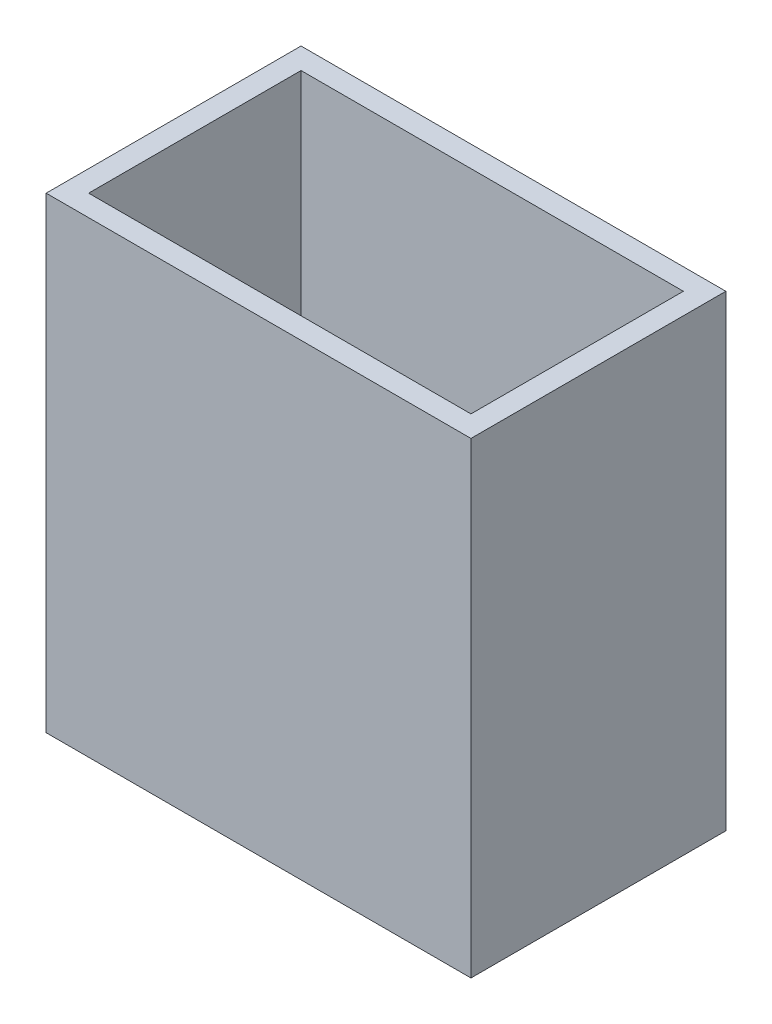
ISO-10303-21;
HEADER;
FILE_DESCRIPTION(('STEP AP214'),'2;1');
FILE_NAME('part.step','',(''),(''),'','','');
FILE_SCHEMA(('AUTOMOTIVE_DESIGN { 1 0 10303 214 1 1 1 1 }'));
ENDSEC;
DATA;
#1=APPLICATION_CONTEXT('core data for automotive mechanical design processes');
#2=APPLICATION_PROTOCOL_DEFINITION('international standard','automotive_design',2000,#1);
#3=PRODUCT_CONTEXT('',#1,'mechanical');
#4=PRODUCT('Part','Part','',(#3));
#5=PRODUCT_RELATED_PRODUCT_CATEGORY('part','',(#4));
#6=PRODUCT_DEFINITION_FORMATION('','',#4);
#7=PRODUCT_DEFINITION_CONTEXT('part definition',#1,'design');
#8=PRODUCT_DEFINITION('design','',#6,#7);
#9=PRODUCT_DEFINITION_SHAPE('','',#8);
#10=(LENGTH_UNIT() NAMED_UNIT(*) SI_UNIT(.MILLI.,.METRE.));
#11=(NAMED_UNIT(*) PLANE_ANGLE_UNIT() SI_UNIT($,.RADIAN.));
#12=(NAMED_UNIT(*) SI_UNIT($,.STERADIAN.) SOLID_ANGLE_UNIT());
#13=UNCERTAINTY_MEASURE_WITH_UNIT(LENGTH_MEASURE(1.E-05),#10,'distance_accuracy_value','');
#14=(GEOMETRIC_REPRESENTATION_CONTEXT(3) GLOBAL_UNCERTAINTY_ASSIGNED_CONTEXT((#13)) GLOBAL_UNIT_ASSIGNED_CONTEXT((#10,
#11,#12)) REPRESENTATION_CONTEXT('',''));
#15=CARTESIAN_POINT('',(0.,0.,0.));
#16=DIRECTION('',(0.,0.,1.));
#17=DIRECTION('',(1.,0.,0.));
#18=AXIS2_PLACEMENT_3D('',#15,#16,#17);
#19=CARTESIAN_POINT('',(0.,80.0462962962963,0.));
#20=DIRECTION('',(0.,1.,0.));
#21=DIRECTION('',(1.,0.,0.));
#22=AXIS2_PLACEMENT_3D('',#19,#20,#21);
#23=PLANE('',#22);
#24=DIRECTION('',(0.,0.,1.));
#25=VECTOR('',#24,1.);
#26=CARTESIAN_POINT('',(10.,80.0462962962963,10.));
#27=LINE('',#26,#25);
#28=CARTESIAN_POINT('',(10.,80.0462962962963,10.));
#29=VERTEX_POINT('',#28);
#30=CARTESIAN_POINT('',(10.,80.0462962962963,110.));
#31=VERTEX_POINT('',#30);
#32=EDGE_CURVE('E178',#29,#31,#27,.T.);
#33=ORIENTED_EDGE('',*,*,#32,.T.);
#34=DIRECTION('',(1.,0.,0.));
#35=VECTOR('',#34,1.);
#36=CARTESIAN_POINT('',(10.,80.0462962962963,110.));
#37=LINE('',#36,#35);
#38=CARTESIAN_POINT('',(190.,80.0462962962963,110.));
#39=VERTEX_POINT('',#38);
#40=EDGE_CURVE('E10',#31,#39,#37,.T.);
#41=ORIENTED_EDGE('',*,*,#40,.T.);
#42=DIRECTION('',(0.,0.,-1.));
#43=VECTOR('',#42,1.);
#44=CARTESIAN_POINT('',(190.,80.0462962962963,10.));
#45=LINE('',#44,#43);
#46=CARTESIAN_POINT('',(190.,80.0462962962963,10.));
#47=VERTEX_POINT('',#46);
#48=EDGE_CURVE('E324',#39,#47,#45,.T.);
#49=ORIENTED_EDGE('',*,*,#48,.T.);
#50=DIRECTION('',(-1.,0.,0.));
#51=VECTOR('',#50,1.);
#52=CARTESIAN_POINT('',(10.,80.0462962962963,10.));
#53=LINE('',#52,#51);
#54=EDGE_CURVE('E174',#47,#29,#53,.T.);
#55=ORIENTED_EDGE('',*,*,#54,.T.);
#56=EDGE_LOOP('',(#33,#41,#49,#55));
#57=FACE_BOUND('',#56,.T.);
#58=ADVANCED_FACE('F15',(#57),#23,.T.);
#59=CARTESIAN_POINT('',(10.,80.0462962962963,110.));
#60=DIRECTION('',(0.,0.,1.));
#61=DIRECTION('',(1.,0.,0.));
#62=AXIS2_PLACEMENT_3D('',#59,#60,#61);
#63=PLANE('',#62);
#64=DIRECTION('',(1.,0.,0.));
#65=VECTOR('',#64,1.);
#66=CARTESIAN_POINT('',(10.,290.046296296296,110.));
#67=LINE('',#66,#65);
#68=CARTESIAN_POINT('',(10.,290.046296296296,110.));
#69=VERTEX_POINT('',#68);
#70=CARTESIAN_POINT('',(190.,290.046296296296,110.));
#71=VERTEX_POINT('',#70);
#72=EDGE_CURVE('E194',#69,#71,#67,.T.);
#73=ORIENTED_EDGE('',*,*,#72,.T.);
#74=DIRECTION('',(0.,1.,0.));
#75=VECTOR('',#74,1.);
#76=CARTESIAN_POINT('',(190.,80.0462962962963,110.));
#77=LINE('',#76,#75);
#78=EDGE_CURVE('E19',#39,#71,#77,.T.);
#79=ORIENTED_EDGE('',*,*,#78,.F.);
#80=ORIENTED_EDGE('',*,*,#40,.F.);
#81=DIRECTION('',(0.,1.,0.));
#82=VECTOR('',#81,1.);
#83=CARTESIAN_POINT('',(10.,80.0462962962963,110.));
#84=LINE('',#83,#82);
#85=EDGE_CURVE('E92',#31,#69,#84,.T.);
#86=ORIENTED_EDGE('',*,*,#85,.T.);
#87=EDGE_LOOP('',(#73,#79,#80,#86));
#88=FACE_BOUND('',#87,.T.);
#89=ADVANCED_FACE('F288',(#88),#63,.F.);
#90=CARTESIAN_POINT('',(190.,80.0462962962963,10.));
#91=DIRECTION('',(1.,0.,0.));
#92=DIRECTION('',(0.,1.,0.));
#93=AXIS2_PLACEMENT_3D('',#90,#91,#92);
#94=PLANE('',#93);
#95=DIRECTION('',(0.,0.,-1.));
#96=VECTOR('',#95,1.);
#97=CARTESIAN_POINT('',(190.,290.046296296296,10.));
#98=LINE('',#97,#96);
#99=CARTESIAN_POINT('',(190.,290.046296296296,10.));
#100=VERTEX_POINT('',#99);
#101=EDGE_CURVE('E190',#71,#100,#98,.T.);
#102=ORIENTED_EDGE('',*,*,#101,.T.);
#103=DIRECTION('',(0.,1.,0.));
#104=VECTOR('',#103,1.);
#105=CARTESIAN_POINT('',(190.,80.0462962962963,10.));
#106=LINE('',#105,#104);
#107=EDGE_CURVE('E147',#47,#100,#106,.T.);
#108=ORIENTED_EDGE('',*,*,#107,.F.);
#109=ORIENTED_EDGE('',*,*,#48,.F.);
#110=ORIENTED_EDGE('',*,*,#78,.T.);
#111=EDGE_LOOP('',(#102,#108,#109,#110));
#112=FACE_BOUND('',#111,.T.);
#113=ADVANCED_FACE('F275',(#112),#94,.F.);
#114=CARTESIAN_POINT('',(10.,80.0462962962963,10.));
#115=DIRECTION('',(0.,0.,-1.));
#116=DIRECTION('',(0.,-1.,0.));
#117=AXIS2_PLACEMENT_3D('',#114,#115,#116);
#118=PLANE('',#117);
#119=DIRECTION('',(-1.,0.,0.));
#120=VECTOR('',#119,1.);
#121=CARTESIAN_POINT('',(10.,290.046296296296,10.));
#122=LINE('',#121,#120);
#123=CARTESIAN_POINT('',(10.,290.046296296296,10.));
#124=VERTEX_POINT('',#123);
#125=EDGE_CURVE('E373',#100,#124,#122,.T.);
#126=ORIENTED_EDGE('',*,*,#125,.T.);
#127=DIRECTION('',(0.,1.,0.));
#128=VECTOR('',#127,1.);
#129=CARTESIAN_POINT('',(10.,80.0462962962963,10.));
#130=LINE('',#129,#128);
#131=EDGE_CURVE('E176',#29,#124,#130,.T.);
#132=ORIENTED_EDGE('',*,*,#131,.F.);
#133=ORIENTED_EDGE('',*,*,#54,.F.);
#134=ORIENTED_EDGE('',*,*,#107,.T.);
#135=EDGE_LOOP('',(#126,#132,#133,#134));
#136=FACE_BOUND('',#135,.T.);
#137=ADVANCED_FACE('F224',(#136),#118,.F.);
#138=CARTESIAN_POINT('',(10.,80.0462962962963,10.));
#139=DIRECTION('',(-1.,0.,0.));
#140=DIRECTION('',(0.,1.,0.));
#141=AXIS2_PLACEMENT_3D('',#138,#139,#140);
#142=PLANE('',#141);
#143=DIRECTION('',(0.,0.,1.));
#144=VECTOR('',#143,1.);
#145=CARTESIAN_POINT('',(10.,290.046296296296,10.));
#146=LINE('',#145,#144);
#147=EDGE_CURVE('E370',#124,#69,#146,.T.);
#148=ORIENTED_EDGE('',*,*,#147,.T.);
#149=ORIENTED_EDGE('',*,*,#85,.F.);
#150=ORIENTED_EDGE('',*,*,#32,.F.);
#151=ORIENTED_EDGE('',*,*,#131,.T.);
#152=EDGE_LOOP('',(#148,#149,#150,#151));
#153=FACE_BOUND('',#152,.T.);
#154=ADVANCED_FACE('F212',(#153),#142,.F.);
#155=CARTESIAN_POINT('',(0.,0.,0.));
#156=DIRECTION('',(0.,0.,1.));
#157=DIRECTION('',(1.,0.,0.));
#158=AXIS2_PLACEMENT_3D('',#155,#156,#157);
#159=PLANE('',#158);
#160=DIRECTION('',(0.,-1.,0.));
#161=VECTOR('',#160,1.);
#162=CARTESIAN_POINT('',(0.,290.046296296296,0.));
#163=LINE('',#162,#161);
#164=CARTESIAN_POINT('',(0.,290.046296296296,0.));
#165=VERTEX_POINT('',#164);
#166=CARTESIAN_POINT('',(0.,70.0462962962963,0.));
#167=VERTEX_POINT('',#166);
#168=EDGE_CURVE('E149',#165,#167,#163,.T.);
#169=ORIENTED_EDGE('',*,*,#168,.F.);
#170=DIRECTION('',(-1.,0.,0.));
#171=VECTOR('',#170,1.);
#172=CARTESIAN_POINT('',(0.,290.046296296296,0.));
#173=LINE('',#172,#171);
#174=CARTESIAN_POINT('',(200.,290.046296296296,0.));
#175=VERTEX_POINT('',#174);
#176=EDGE_CURVE('E114',#175,#165,#173,.T.);
#177=ORIENTED_EDGE('',*,*,#176,.F.);
#178=DIRECTION('',(0.,1.,0.));
#179=VECTOR('',#178,1.);
#180=CARTESIAN_POINT('',(200.,290.046296296296,0.));
#181=LINE('',#180,#179);
#182=CARTESIAN_POINT('',(200.,70.0462962962963,0.));
#183=VERTEX_POINT('',#182);
#184=EDGE_CURVE('E107',#183,#175,#181,.T.);
#185=ORIENTED_EDGE('',*,*,#184,.F.);
#186=DIRECTION('',(1.,0.,0.));
#187=VECTOR('',#186,1.);
#188=CARTESIAN_POINT('',(0.,70.0462962962963,0.));
#189=LINE('',#188,#187);
#190=EDGE_CURVE('E111',#167,#183,#189,.T.);
#191=ORIENTED_EDGE('',*,*,#190,.F.);
#192=EDGE_LOOP('',(#169,#177,#185,#191));
#193=FACE_BOUND('',#192,.T.);
#194=ADVANCED_FACE('F17',(#193),#159,.F.);
#195=CARTESIAN_POINT('',(0.,0.,120.));
#196=DIRECTION('',(0.,0.,1.));
#197=DIRECTION('',(1.,0.,0.));
#198=AXIS2_PLACEMENT_3D('',#195,#196,#197);
#199=PLANE('',#198);
#200=DIRECTION('',(0.,-1.,0.));
#201=VECTOR('',#200,1.);
#202=CARTESIAN_POINT('',(0.,290.046296296296,120.));
#203=LINE('',#202,#201);
#204=CARTESIAN_POINT('',(0.,290.046296296296,120.));
#205=VERTEX_POINT('',#204);
#206=CARTESIAN_POINT('',(0.,70.0462962962963,120.));
#207=VERTEX_POINT('',#206);
#208=EDGE_CURVE('E143',#205,#207,#203,.T.);
#209=ORIENTED_EDGE('',*,*,#208,.T.);
#210=DIRECTION('',(1.,0.,0.));
#211=VECTOR('',#210,1.);
#212=CARTESIAN_POINT('',(0.,70.0462962962963,120.));
#213=LINE('',#212,#211);
#214=CARTESIAN_POINT('',(200.,70.0462962962963,120.));
#215=VERTEX_POINT('',#214);
#216=EDGE_CURVE('E120',#207,#215,#213,.T.);
#217=ORIENTED_EDGE('',*,*,#216,.T.);
#218=DIRECTION('',(0.,1.,0.));
#219=VECTOR('',#218,1.);
#220=CARTESIAN_POINT('',(200.,290.046296296296,120.));
#221=LINE('',#220,#219);
#222=CARTESIAN_POINT('',(200.,290.046296296296,120.));
#223=VERTEX_POINT('',#222);
#224=EDGE_CURVE('E125',#215,#223,#221,.T.);
#225=ORIENTED_EDGE('',*,*,#224,.T.);
#226=DIRECTION('',(-1.,0.,0.));
#227=VECTOR('',#226,1.);
#228=CARTESIAN_POINT('',(0.,290.046296296296,120.));
#229=LINE('',#228,#227);
#230=EDGE_CURVE('E158',#223,#205,#229,.T.);
#231=ORIENTED_EDGE('',*,*,#230,.T.);
#232=EDGE_LOOP('',(#209,#217,#225,#231));
#233=FACE_BOUND('',#232,.T.);
#234=ADVANCED_FACE('F156',(#233),#199,.T.);
#235=CARTESIAN_POINT('',(0.,290.046296296296,120.));
#236=DIRECTION('',(0.,-1.,0.));
#237=DIRECTION('',(0.,0.,-1.));
#238=AXIS2_PLACEMENT_3D('',#235,#236,#237);
#239=PLANE('',#238);
#240=ORIENTED_EDGE('',*,*,#72,.F.);
#241=ORIENTED_EDGE('',*,*,#147,.F.);
#242=ORIENTED_EDGE('',*,*,#125,.F.);
#243=ORIENTED_EDGE('',*,*,#101,.F.);
#244=EDGE_LOOP('',(#240,#241,#242,#243));
#245=FACE_BOUND('',#244,.T.);
#246=ORIENTED_EDGE('',*,*,#176,.T.);
#247=DIRECTION('',(0.,0.,-1.));
#248=VECTOR('',#247,1.);
#249=CARTESIAN_POINT('',(0.,290.046296296296,120.));
#250=LINE('',#249,#248);
#251=EDGE_CURVE('E135',#205,#165,#250,.T.);
#252=ORIENTED_EDGE('',*,*,#251,.F.);
#253=ORIENTED_EDGE('',*,*,#230,.F.);
#254=DIRECTION('',(0.,0.,-1.));
#255=VECTOR('',#254,1.);
#256=CARTESIAN_POINT('',(200.,290.046296296296,120.));
#257=LINE('',#256,#255);
#258=EDGE_CURVE('E119',#223,#175,#257,.T.);
#259=ORIENTED_EDGE('',*,*,#258,.T.);
#260=EDGE_LOOP('',(#246,#252,#253,#259));
#261=FACE_BOUND('',#260,.T.);
#262=ADVANCED_FACE('F199',(#245,#261),#239,.F.);
#263=CARTESIAN_POINT('',(200.,290.046296296296,120.));
#264=DIRECTION('',(-1.,0.,0.));
#265=DIRECTION('',(0.,1.,0.));
#266=AXIS2_PLACEMENT_3D('',#263,#264,#265);
#267=PLANE('',#266);
#268=ORIENTED_EDGE('',*,*,#184,.T.);
#269=ORIENTED_EDGE('',*,*,#258,.F.);
#270=ORIENTED_EDGE('',*,*,#224,.F.);
#271=DIRECTION('',(0.,0.,-1.));
#272=VECTOR('',#271,1.);
#273=CARTESIAN_POINT('',(200.,70.0462962962963,120.));
#274=LINE('',#273,#272);
#275=EDGE_CURVE('E122',#215,#183,#274,.T.);
#276=ORIENTED_EDGE('',*,*,#275,.T.);
#277=EDGE_LOOP('',(#268,#269,#270,#276));
#278=FACE_BOUND('',#277,.T.);
#279=ADVANCED_FACE('F123',(#278),#267,.F.);
#280=CARTESIAN_POINT('',(0.,70.0462962962963,120.));
#281=DIRECTION('',(0.,1.,0.));
#282=DIRECTION('',(1.,0.,0.));
#283=AXIS2_PLACEMENT_3D('',#280,#281,#282);
#284=PLANE('',#283);
#285=ORIENTED_EDGE('',*,*,#190,.T.);
#286=ORIENTED_EDGE('',*,*,#275,.F.);
#287=ORIENTED_EDGE('',*,*,#216,.F.);
#288=DIRECTION('',(0.,0.,-1.));
#289=VECTOR('',#288,1.);
#290=CARTESIAN_POINT('',(0.,70.0462962962963,120.));
#291=LINE('',#290,#289);
#292=EDGE_CURVE('E132',#207,#167,#291,.T.);
#293=ORIENTED_EDGE('',*,*,#292,.T.);
#294=EDGE_LOOP('',(#285,#286,#287,#293));
#295=FACE_BOUND('',#294,.T.);
#296=ADVANCED_FACE('F130',(#295),#284,.F.);
#297=CARTESIAN_POINT('',(0.,290.046296296296,120.));
#298=DIRECTION('',(1.,0.,0.));
#299=DIRECTION('',(0.,1.,0.));
#300=AXIS2_PLACEMENT_3D('',#297,#298,#299);
#301=PLANE('',#300);
#302=ORIENTED_EDGE('',*,*,#168,.T.);
#303=ORIENTED_EDGE('',*,*,#292,.F.);
#304=ORIENTED_EDGE('',*,*,#208,.F.);
#305=ORIENTED_EDGE('',*,*,#251,.T.);
#306=EDGE_LOOP('',(#302,#303,#304,#305));
#307=FACE_BOUND('',#306,.T.);
#308=ADVANCED_FACE('F163',(#307),#301,.F.);
#309=CLOSED_SHELL('',(#58,#89,#113,#137,#154,#194,#234,#262,#279,#296,#308));
#310=MANIFOLD_SOLID_BREP('B1',#309);
#311=ADVANCED_BREP_SHAPE_REPRESENTATION('',(#18,#310),#14);
#312=SHAPE_DEFINITION_REPRESENTATION(#9,#311);
ENDSEC;
END-ISO-10303-21;
